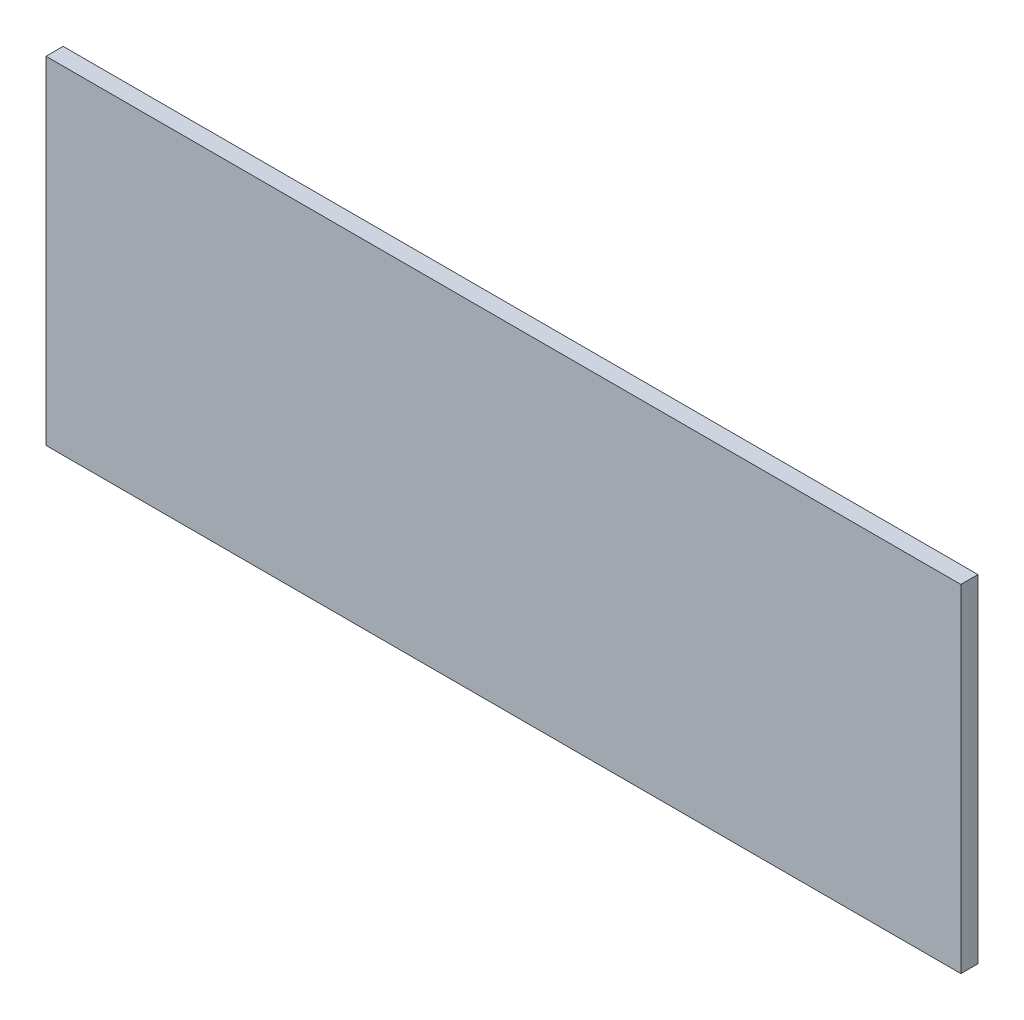
ISO-10303-21;
HEADER;
FILE_DESCRIPTION(('STEP AP214'),'2;1');
FILE_NAME('part.step','',(''),(''),'','','');
FILE_SCHEMA(('AUTOMOTIVE_DESIGN { 1 0 10303 214 1 1 1 1 }'));
ENDSEC;
DATA;
#1=APPLICATION_CONTEXT('core data for automotive mechanical design processes');
#2=APPLICATION_PROTOCOL_DEFINITION('international standard','automotive_design',2000,#1);
#3=PRODUCT_CONTEXT('',#1,'mechanical');
#4=PRODUCT('Part','Part','',(#3));
#5=PRODUCT_RELATED_PRODUCT_CATEGORY('part','',(#4));
#6=PRODUCT_DEFINITION_FORMATION('','',#4);
#7=PRODUCT_DEFINITION_CONTEXT('part definition',#1,'design');
#8=PRODUCT_DEFINITION('design','',#6,#7);
#9=PRODUCT_DEFINITION_SHAPE('','',#8);
#10=(LENGTH_UNIT() NAMED_UNIT(*) SI_UNIT(.MILLI.,.METRE.));
#11=(NAMED_UNIT(*) PLANE_ANGLE_UNIT() SI_UNIT($,.RADIAN.));
#12=(NAMED_UNIT(*) SI_UNIT($,.STERADIAN.) SOLID_ANGLE_UNIT());
#13=UNCERTAINTY_MEASURE_WITH_UNIT(LENGTH_MEASURE(1.E-05),#10,'distance_accuracy_value','');
#14=(GEOMETRIC_REPRESENTATION_CONTEXT(3) GLOBAL_UNCERTAINTY_ASSIGNED_CONTEXT((#13)) GLOBAL_UNIT_ASSIGNED_CONTEXT((#10,
#11,#12)) REPRESENTATION_CONTEXT('',''));
#15=CARTESIAN_POINT('',(0.,0.,0.));
#16=DIRECTION('',(0.,0.,1.));
#17=DIRECTION('',(1.,0.,0.));
#18=AXIS2_PLACEMENT_3D('',#15,#16,#17);
#19=CARTESIAN_POINT('',(81.8669967651367,61.3370018005371,0.));
#20=DIRECTION('',(0.,1.,0.));
#21=DIRECTION('',(1.,0.,0.));
#22=AXIS2_PLACEMENT_3D('',#19,#20,#21);
#23=PLANE('',#22);
#24=DIRECTION('',(1.,0.,0.));
#25=VECTOR('',#24,1.);
#26=CARTESIAN_POINT('',(81.8669967651367,61.3370018005371,0.03556));
#27=LINE('',#26,#25);
#28=CARTESIAN_POINT('',(81.8669967651367,61.3370018005371,0.03556));
#29=VERTEX_POINT('',#28);
#30=CARTESIAN_POINT('',(83.7669982910156,61.3370018005371,0.03556));
#31=VERTEX_POINT('',#30);
#32=EDGE_CURVE('E11',#29,#31,#27,.T.);
#33=ORIENTED_EDGE('',*,*,#32,.F.);
#34=DIRECTION('',(0.,0.,1.));
#35=VECTOR('',#34,1.);
#36=CARTESIAN_POINT('',(81.8669967651367,61.3370018005371,0.));
#37=LINE('',#36,#35);
#38=CARTESIAN_POINT('',(81.8669967651367,61.3370018005371,0.));
#39=VERTEX_POINT('',#38);
#40=EDGE_CURVE('E24',#39,#29,#37,.T.);
#41=ORIENTED_EDGE('',*,*,#40,.F.);
#42=DIRECTION('',(1.,0.,0.));
#43=VECTOR('',#42,1.);
#44=CARTESIAN_POINT('',(81.8669967651367,61.3370018005371,0.));
#45=LINE('',#44,#43);
#46=CARTESIAN_POINT('',(83.7669982910156,61.3370018005371,0.));
#47=VERTEX_POINT('',#46);
#48=EDGE_CURVE('E75',#39,#47,#45,.T.);
#49=ORIENTED_EDGE('',*,*,#48,.T.);
#50=DIRECTION('',(0.,0.,1.));
#51=VECTOR('',#50,1.);
#52=CARTESIAN_POINT('',(83.7669982910156,61.3370018005371,0.));
#53=LINE('',#52,#51);
#54=EDGE_CURVE('E37',#47,#31,#53,.T.);
#55=ORIENTED_EDGE('',*,*,#54,.T.);
#56=EDGE_LOOP('',(#33,#41,#49,#55));
#57=FACE_BOUND('',#56,.T.);
#58=ADVANCED_FACE('F17',(#57),#23,.F.);
#59=CARTESIAN_POINT('',(83.7669982910156,61.3370018005371,0.));
#60=DIRECTION('',(-1.,0.,0.));
#61=DIRECTION('',(0.,1.,0.));
#62=AXIS2_PLACEMENT_3D('',#59,#60,#61);
#63=PLANE('',#62);
#64=DIRECTION('',(0.,1.,0.));
#65=VECTOR('',#64,1.);
#66=CARTESIAN_POINT('',(83.7669982910156,61.3370018005371,0.03556));
#67=LINE('',#66,#65);
#68=CARTESIAN_POINT('',(83.7669982910156,62.0369987487793,0.03556));
#69=VERTEX_POINT('',#68);
#70=EDGE_CURVE('E83',#31,#69,#67,.T.);
#71=ORIENTED_EDGE('',*,*,#70,.F.);
#72=ORIENTED_EDGE('',*,*,#54,.F.);
#73=DIRECTION('',(0.,1.,0.));
#74=VECTOR('',#73,1.);
#75=CARTESIAN_POINT('',(83.7669982910156,61.3370018005371,0.));
#76=LINE('',#75,#74);
#77=CARTESIAN_POINT('',(83.7669982910156,62.0369987487793,0.));
#78=VERTEX_POINT('',#77);
#79=EDGE_CURVE('E81',#47,#78,#76,.T.);
#80=ORIENTED_EDGE('',*,*,#79,.T.);
#81=DIRECTION('',(0.,0.,1.));
#82=VECTOR('',#81,1.);
#83=CARTESIAN_POINT('',(83.7669982910156,62.0369987487793,0.));
#84=LINE('',#83,#82);
#85=EDGE_CURVE('E67',#78,#69,#84,.T.);
#86=ORIENTED_EDGE('',*,*,#85,.T.);
#87=EDGE_LOOP('',(#71,#72,#80,#86));
#88=FACE_BOUND('',#87,.T.);
#89=ADVANCED_FACE('F89',(#88),#63,.F.);
#90=CARTESIAN_POINT('',(83.7669982910156,62.0369987487793,0.));
#91=DIRECTION('',(0.,-1.,0.));
#92=DIRECTION('',(-1.,0.,0.));
#93=AXIS2_PLACEMENT_3D('',#90,#91,#92);
#94=PLANE('',#93);
#95=DIRECTION('',(-1.,0.,0.));
#96=VECTOR('',#95,1.);
#97=CARTESIAN_POINT('',(83.7669982910156,62.0369987487793,0.03556));
#98=LINE('',#97,#96);
#99=CARTESIAN_POINT('',(81.8669967651367,62.0369987487793,0.03556));
#100=VERTEX_POINT('',#99);
#101=EDGE_CURVE('E71',#69,#100,#98,.T.);
#102=ORIENTED_EDGE('',*,*,#101,.F.);
#103=ORIENTED_EDGE('',*,*,#85,.F.);
#104=DIRECTION('',(-1.,0.,0.));
#105=VECTOR('',#104,1.);
#106=CARTESIAN_POINT('',(83.7669982910156,62.0369987487793,0.));
#107=LINE('',#106,#105);
#108=CARTESIAN_POINT('',(81.8669967651367,62.0369987487793,0.));
#109=VERTEX_POINT('',#108);
#110=EDGE_CURVE('E63',#78,#109,#107,.T.);
#111=ORIENTED_EDGE('',*,*,#110,.T.);
#112=DIRECTION('',(0.,0.,1.));
#113=VECTOR('',#112,1.);
#114=CARTESIAN_POINT('',(81.8669967651367,62.0369987487793,0.));
#115=LINE('',#114,#113);
#116=EDGE_CURVE('E53',#109,#100,#115,.T.);
#117=ORIENTED_EDGE('',*,*,#116,.T.);
#118=EDGE_LOOP('',(#102,#103,#111,#117));
#119=FACE_BOUND('',#118,.T.);
#120=ADVANCED_FACE('F66',(#119),#94,.F.);
#121=CARTESIAN_POINT('',(81.8669967651367,62.0369987487793,0.));
#122=DIRECTION('',(1.,0.,0.));
#123=DIRECTION('',(0.,-1.,0.));
#124=AXIS2_PLACEMENT_3D('',#121,#122,#123);
#125=PLANE('',#124);
#126=DIRECTION('',(0.,-1.,0.));
#127=VECTOR('',#126,1.);
#128=CARTESIAN_POINT('',(81.8669967651367,62.0369987487793,0.03556));
#129=LINE('',#128,#127);
#130=EDGE_CURVE('E59',#100,#29,#129,.T.);
#131=ORIENTED_EDGE('',*,*,#130,.F.);
#132=ORIENTED_EDGE('',*,*,#116,.F.);
#133=DIRECTION('',(0.,-1.,0.));
#134=VECTOR('',#133,1.);
#135=CARTESIAN_POINT('',(81.8669967651367,62.0369987487793,0.));
#136=LINE('',#135,#134);
#137=EDGE_CURVE('E57',#109,#39,#136,.T.);
#138=ORIENTED_EDGE('',*,*,#137,.T.);
#139=ORIENTED_EDGE('',*,*,#40,.T.);
#140=EDGE_LOOP('',(#131,#132,#138,#139));
#141=FACE_BOUND('',#140,.T.);
#142=ADVANCED_FACE('F55',(#141),#125,.F.);
#143=CARTESIAN_POINT('',(81.8669967651367,61.3370018005371,0.));
#144=DIRECTION('',(0.,0.,-1.));
#145=DIRECTION('',(-1.,0.,0.));
#146=AXIS2_PLACEMENT_3D('',#143,#144,#145);
#147=PLANE('',#146);
#148=ORIENTED_EDGE('',*,*,#137,.F.);
#149=ORIENTED_EDGE('',*,*,#110,.F.);
#150=ORIENTED_EDGE('',*,*,#79,.F.);
#151=ORIENTED_EDGE('',*,*,#48,.F.);
#152=EDGE_LOOP('',(#148,#149,#150,#151));
#153=FACE_BOUND('',#152,.T.);
#154=ADVANCED_FACE('F74',(#153),#147,.T.);
#155=CARTESIAN_POINT('',(81.8669967651367,61.3370018005371,0.03556));
#156=DIRECTION('',(0.,0.,-1.));
#157=DIRECTION('',(-1.,0.,0.));
#158=AXIS2_PLACEMENT_3D('',#155,#156,#157);
#159=PLANE('',#158);
#160=ORIENTED_EDGE('',*,*,#32,.T.);
#161=ORIENTED_EDGE('',*,*,#70,.T.);
#162=ORIENTED_EDGE('',*,*,#101,.T.);
#163=ORIENTED_EDGE('',*,*,#130,.T.);
#164=EDGE_LOOP('',(#160,#161,#162,#163));
#165=FACE_BOUND('',#164,.T.);
#166=ADVANCED_FACE('F91',(#165),#159,.F.);
#167=CLOSED_SHELL('',(#58,#89,#120,#142,#154,#166));
#168=MANIFOLD_SOLID_BREP('B1',#167);
#169=ADVANCED_BREP_SHAPE_REPRESENTATION('',(#18,#168),#14);
#170=SHAPE_DEFINITION_REPRESENTATION(#9,#169);
ENDSEC;
END-ISO-10303-21;
